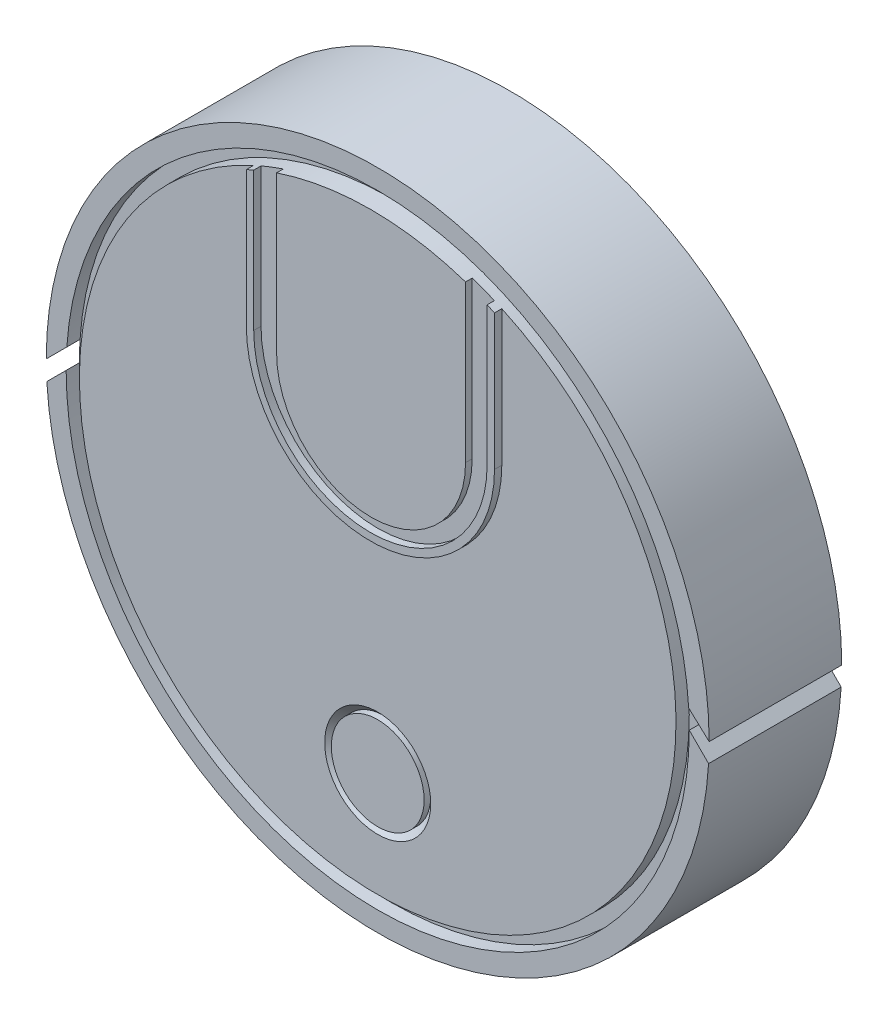
ISO-10303-21;
HEADER;
FILE_DESCRIPTION(('STEP AP214'),'2;1');
FILE_NAME('part.step','',(''),(''),'','','');
FILE_SCHEMA(('AUTOMOTIVE_DESIGN { 1 0 10303 214 1 1 1 1 }'));
ENDSEC;
DATA;
#1=APPLICATION_CONTEXT('core data for automotive mechanical design processes');
#2=APPLICATION_PROTOCOL_DEFINITION('international standard','automotive_design',2000,#1);
#3=PRODUCT_CONTEXT('',#1,'mechanical');
#4=PRODUCT('Part','Part','',(#3));
#5=PRODUCT_RELATED_PRODUCT_CATEGORY('part','',(#4));
#6=PRODUCT_DEFINITION_FORMATION('','',#4);
#7=PRODUCT_DEFINITION_CONTEXT('part definition',#1,'design');
#8=PRODUCT_DEFINITION('design','',#6,#7);
#9=PRODUCT_DEFINITION_SHAPE('','',#8);
#10=(LENGTH_UNIT() NAMED_UNIT(*) SI_UNIT(.MILLI.,.METRE.));
#11=(NAMED_UNIT(*) PLANE_ANGLE_UNIT() SI_UNIT($,.RADIAN.));
#12=(NAMED_UNIT(*) SI_UNIT($,.STERADIAN.) SOLID_ANGLE_UNIT());
#13=UNCERTAINTY_MEASURE_WITH_UNIT(LENGTH_MEASURE(1.E-05),#10,'distance_accuracy_value','');
#14=(GEOMETRIC_REPRESENTATION_CONTEXT(3) GLOBAL_UNCERTAINTY_ASSIGNED_CONTEXT((#13)) GLOBAL_UNIT_ASSIGNED_CONTEXT((#10,
#11,#12)) REPRESENTATION_CONTEXT('',''));
#15=CARTESIAN_POINT('',(0.,0.,0.));
#16=DIRECTION('',(0.,0.,1.));
#17=DIRECTION('',(1.,0.,0.));
#18=AXIS2_PLACEMENT_3D('',#15,#16,#17);
#19=CARTESIAN_POINT('',(0.,0.,20.));
#20=DIRECTION('',(0.,0.,1.));
#21=DIRECTION('',(1.,0.,0.));
#22=AXIS2_PLACEMENT_3D('',#19,#20,#21);
#23=PLANE('',#22);
#24=DIRECTION('',(0.,1.,0.));
#25=VECTOR('',#24,1.);
#26=CARTESIAN_POINT('',(-17.6027975874737,41.4142670718006,20.));
#27=LINE('',#26,#25);
#28=CARTESIAN_POINT('',(-17.6027975874737,20.4667448140072,20.));
#29=VERTEX_POINT('',#28);
#30=CARTESIAN_POINT('',(-17.6027975874737,41.4142670718006,20.));
#31=VERTEX_POINT('',#30);
#32=EDGE_CURVE('E54',#29,#31,#27,.T.);
#33=ORIENTED_EDGE('',*,*,#32,.F.);
#34=CARTESIAN_POINT('',(0.,20.4667448140072,20.));
#35=DIRECTION('',(0.,0.,-1.));
#36=DIRECTION('',(1.,0.,0.));
#37=AXIS2_PLACEMENT_3D('',#34,#35,#36);
#38=CIRCLE('',#37,17.6027975874737);
#39=CARTESIAN_POINT('',(17.6027975874737,20.4667448140072,20.));
#40=VERTEX_POINT('',#39);
#41=EDGE_CURVE('E59',#40,#29,#38,.T.);
#42=ORIENTED_EDGE('',*,*,#41,.F.);
#43=DIRECTION('',(0.,-1.,0.));
#44=VECTOR('',#43,1.);
#45=CARTESIAN_POINT('',(17.6027975874737,41.4142670718006,20.));
#46=LINE('',#45,#44);
#47=CARTESIAN_POINT('',(17.6027975874737,41.4142670718006,20.));
#48=VERTEX_POINT('',#47);
#49=EDGE_CURVE('E232',#48,#40,#46,.T.);
#50=ORIENTED_EDGE('',*,*,#49,.F.);
#51=CARTESIAN_POINT('',(0.,0.,20.));
#52=DIRECTION('',(0.,0.,1.));
#53=DIRECTION('',(1.,0.,0.));
#54=AXIS2_PLACEMENT_3D('',#51,#52,#53);
#55=CIRCLE('',#54,45.);
#56=CARTESIAN_POINT('',(14.2498837612882,42.6841986312239,20.));
#57=VERTEX_POINT('',#56);
#58=EDGE_CURVE('E293',#48,#57,#55,.T.);
#59=ORIENTED_EDGE('',*,*,#58,.T.);
#60=DIRECTION('',(0.,1.,0.));
#61=VECTOR('',#60,1.);
#62=CARTESIAN_POINT('',(14.2498837612882,42.6841986312239,20.));
#63=LINE('',#62,#61);
#64=CARTESIAN_POINT('',(14.2498837612882,19.0696973864299,20.));
#65=VERTEX_POINT('',#64);
#66=EDGE_CURVE('E266',#65,#57,#63,.T.);
#67=ORIENTED_EDGE('',*,*,#66,.F.);
#68=CARTESIAN_POINT('',(0.,19.0696973864299,20.));
#69=DIRECTION('',(0.,0.,1.));
#70=DIRECTION('',(1.,0.,0.));
#71=AXIS2_PLACEMENT_3D('',#68,#69,#70);
#72=CIRCLE('',#71,14.2498837612882);
#73=CARTESIAN_POINT('',(-14.2498837612882,19.0696973864299,20.));
#74=VERTEX_POINT('',#73);
#75=EDGE_CURVE('E241',#74,#65,#72,.T.);
#76=ORIENTED_EDGE('',*,*,#75,.F.);
#77=DIRECTION('',(0.,-1.,0.));
#78=VECTOR('',#77,1.);
#79=CARTESIAN_POINT('',(-14.2498837612882,42.6841986312239,20.));
#80=LINE('',#79,#78);
#81=CARTESIAN_POINT('',(-14.2498837612882,42.6841986312239,20.));
#82=VERTEX_POINT('',#81);
#83=EDGE_CURVE('E257',#82,#74,#80,.T.);
#84=ORIENTED_EDGE('',*,*,#83,.F.);
#85=EDGE_CURVE('E289',#82,#31,#55,.T.);
#86=ORIENTED_EDGE('',*,*,#85,.T.);
#87=EDGE_LOOP('',(#33,#42,#50,#59,#67,#76,#84,#86));
#88=FACE_BOUND('',#87,.T.);
#89=ADVANCED_FACE('F38',(#88),#23,.T.);
#90=CARTESIAN_POINT('',(0.,0.,18.));
#91=DIRECTION('',(0.,0.,-1.));
#92=DIRECTION('',(-1.,0.,0.));
#93=AXIS2_PLACEMENT_3D('',#90,#91,#92);
#94=CYLINDRICAL_SURFACE('',#93,47.);
#95=DIRECTION('',(0.,0.,-1.));
#96=VECTOR('',#95,1.);
#97=CARTESIAN_POINT('',(-46.8974884404582,3.10251155954182,20.));
#98=LINE('',#97,#96);
#99=CARTESIAN_POINT('',(-46.8974884404582,3.10251155954182,18.));
#100=VERTEX_POINT('',#99);
#101=CARTESIAN_POINT('',(-46.8974884404582,3.10251155954182,0.));
#102=VERTEX_POINT('',#101);
#103=EDGE_CURVE('E318',#100,#102,#98,.T.);
#104=ORIENTED_EDGE('',*,*,#103,.T.);
#105=CARTESIAN_POINT('',(0.,0.,0.));
#106=DIRECTION('',(0.,0.,1.));
#107=DIRECTION('',(1.,0.,0.));
#108=AXIS2_PLACEMENT_3D('',#105,#106,#107);
#109=CIRCLE('',#108,47.);
#110=CARTESIAN_POINT('',(-47.,0.,0.));
#111=VERTEX_POINT('',#110);
#112=EDGE_CURVE('E324',#102,#111,#109,.T.);
#113=ORIENTED_EDGE('',*,*,#112,.T.);
#114=DIRECTION('',(0.,0.,-1.));
#115=VECTOR('',#114,1.);
#116=CARTESIAN_POINT('',(-47.,0.,18.));
#117=LINE('',#116,#115);
#118=CARTESIAN_POINT('',(-47.,0.,18.));
#119=VERTEX_POINT('',#118);
#120=EDGE_CURVE('E337',#111,#119,#117,.F.);
#121=ORIENTED_EDGE('',*,*,#120,.T.);
#122=CARTESIAN_POINT('',(0.,0.,18.));
#123=DIRECTION('',(0.,0.,1.));
#124=DIRECTION('',(1.,0.,0.));
#125=AXIS2_PLACEMENT_3D('',#122,#123,#124);
#126=CIRCLE('',#125,47.);
#127=EDGE_CURVE('E330',#100,#119,#126,.T.);
#128=ORIENTED_EDGE('',*,*,#127,.F.);
#129=EDGE_LOOP('',(#104,#113,#121,#128));
#130=FACE_BOUND('',#129,.T.);
#131=ADVANCED_FACE('F375',(#130),#94,.T.);
#132=DIRECTION('',(0.,0.,-1.));
#133=VECTOR('',#132,1.);
#134=CARTESIAN_POINT('',(46.913413370577,2.85160409618335,20.));
#135=LINE('',#134,#133);
#136=CARTESIAN_POINT('',(46.913413370577,2.85160409618335,18.));
#137=VERTEX_POINT('',#136);
#138=CARTESIAN_POINT('',(46.913413370577,2.85160409618335,0.));
#139=VERTEX_POINT('',#138);
#140=EDGE_CURVE('E314',#137,#139,#135,.T.);
#141=ORIENTED_EDGE('',*,*,#140,.F.);
#142=CARTESIAN_POINT('',(47.,0.,18.));
#143=VERTEX_POINT('',#142);
#144=EDGE_CURVE('E325',#143,#137,#126,.T.);
#145=ORIENTED_EDGE('',*,*,#144,.F.);
#146=DIRECTION('',(0.,0.,-1.));
#147=VECTOR('',#146,1.);
#148=CARTESIAN_POINT('',(47.,0.,18.));
#149=LINE('',#148,#147);
#150=CARTESIAN_POINT('',(47.,0.,0.));
#151=VERTEX_POINT('',#150);
#152=EDGE_CURVE('E328',#143,#151,#149,.T.);
#153=ORIENTED_EDGE('',*,*,#152,.T.);
#154=EDGE_CURVE('E332',#151,#139,#109,.T.);
#155=ORIENTED_EDGE('',*,*,#154,.T.);
#156=EDGE_LOOP('',(#141,#145,#153,#155));
#157=FACE_BOUND('',#156,.T.);
#158=ADVANCED_FACE('F400',(#157),#94,.T.);
#159=CARTESIAN_POINT('',(0.,0.,20.));
#160=DIRECTION('',(0.,0.,-1.));
#161=DIRECTION('',(-1.,0.,0.));
#162=AXIS2_PLACEMENT_3D('',#159,#160,#161);
#163=CYLINDRICAL_SURFACE('',#162,47.);
#164=DIRECTION('',(0.,0.,-1.));
#165=VECTOR('',#164,1.);
#166=CARTESIAN_POINT('',(47.,0.,20.));
#167=LINE('',#166,#165);
#168=CARTESIAN_POINT('',(47.,0.,20.));
#169=VERTEX_POINT('',#168);
#170=EDGE_CURVE('E351',#169,#143,#167,.T.);
#171=ORIENTED_EDGE('',*,*,#170,.T.);
#172=EDGE_CURVE('E331',#119,#143,#126,.T.);
#173=ORIENTED_EDGE('',*,*,#172,.F.);
#174=DIRECTION('',(0.,0.,-1.));
#175=VECTOR('',#174,1.);
#176=CARTESIAN_POINT('',(-47.,0.,20.));
#177=LINE('',#176,#175);
#178=CARTESIAN_POINT('',(-47.,0.,20.));
#179=VERTEX_POINT('',#178);
#180=EDGE_CURVE('E47',#179,#119,#177,.T.);
#181=ORIENTED_EDGE('',*,*,#180,.F.);
#182=CARTESIAN_POINT('',(0.,0.,20.));
#183=DIRECTION('',(0.,0.,-1.));
#184=DIRECTION('',(1.,0.,0.));
#185=AXIS2_PLACEMENT_3D('',#182,#183,#184);
#186=CIRCLE('',#185,47.);
#187=EDGE_CURVE('E341',#169,#179,#186,.T.);
#188=ORIENTED_EDGE('',*,*,#187,.F.);
#189=EDGE_LOOP('',(#171,#173,#181,#188));
#190=FACE_BOUND('',#189,.T.);
#191=ADVANCED_FACE('F392',(#190),#163,.F.);
#192=CARTESIAN_POINT('',(-47.,0.,20.));
#193=DIRECTION('',(0.707106781186553,-0.707106781186542,0.));
#194=DIRECTION('',(0.707106781186542,0.707106781186553,0.));
#195=AXIS2_PLACEMENT_3D('',#192,#193,#194);
#196=PLANE('',#195);
#197=DIRECTION('',(-0.707106781186542,-0.707106781186553,0.));
#198=VECTOR('',#197,1.);
#199=CARTESIAN_POINT('',(-47.,0.,0.));
#200=LINE('',#199,#198);
#201=CARTESIAN_POINT('',(-49.9149578837446,-2.91495788374463,0.));
#202=VERTEX_POINT('',#201);
#203=EDGE_CURVE('E340',#111,#202,#200,.T.);
#204=ORIENTED_EDGE('',*,*,#203,.T.);
#205=DIRECTION('',(0.,0.,-1.));
#206=VECTOR('',#205,1.);
#207=CARTESIAN_POINT('',(-49.9149578837446,-2.91495788374463,20.));
#208=LINE('',#207,#206);
#209=CARTESIAN_POINT('',(-49.9149578837446,-2.91495788374463,20.));
#210=VERTEX_POINT('',#209);
#211=EDGE_CURVE('E361',#210,#202,#208,.T.);
#212=ORIENTED_EDGE('',*,*,#211,.F.);
#213=DIRECTION('',(-0.707106781186542,-0.707106781186553,0.));
#214=VECTOR('',#213,1.);
#215=CARTESIAN_POINT('',(-47.,0.,20.));
#216=LINE('',#215,#214);
#217=EDGE_CURVE('E344',#179,#210,#216,.T.);
#218=ORIENTED_EDGE('',*,*,#217,.F.);
#219=ORIENTED_EDGE('',*,*,#180,.T.);
#220=ORIENTED_EDGE('',*,*,#120,.F.);
#221=EDGE_LOOP('',(#204,#212,#218,#219,#220));
#222=FACE_BOUND('',#221,.T.);
#223=ADVANCED_FACE('F367',(#222),#196,.F.);
#224=CARTESIAN_POINT('',(0.,0.,20.));
#225=DIRECTION('',(0.,0.,-1.));
#226=DIRECTION('',(-1.,0.,0.));
#227=AXIS2_PLACEMENT_3D('',#224,#225,#226);
#228=CYLINDRICAL_SURFACE('',#227,50.);
#229=CARTESIAN_POINT('',(0.,0.,0.));
#230=DIRECTION('',(0.,0.,1.));
#231=DIRECTION('',(1.,0.,0.));
#232=AXIS2_PLACEMENT_3D('',#229,#230,#231);
#233=CIRCLE('',#232,50.);
#234=CARTESIAN_POINT('',(49.9149578837446,-2.91495788374451,0.));
#235=VERTEX_POINT('',#234);
#236=EDGE_CURVE('E353',#202,#235,#233,.T.);
#237=ORIENTED_EDGE('',*,*,#236,.T.);
#238=DIRECTION('',(0.,0.,-1.));
#239=VECTOR('',#238,1.);
#240=CARTESIAN_POINT('',(49.9149578837446,-2.91495788374451,20.));
#241=LINE('',#240,#239);
#242=CARTESIAN_POINT('',(49.9149578837446,-2.91495788374451,20.));
#243=VERTEX_POINT('',#242);
#244=EDGE_CURVE('E358',#243,#235,#241,.T.);
#245=ORIENTED_EDGE('',*,*,#244,.F.);
#246=CARTESIAN_POINT('',(0.,0.,20.));
#247=DIRECTION('',(0.,0.,1.));
#248=DIRECTION('',(1.,0.,0.));
#249=AXIS2_PLACEMENT_3D('',#246,#247,#248);
#250=CIRCLE('',#249,50.);
#251=EDGE_CURVE('E347',#210,#243,#250,.T.);
#252=ORIENTED_EDGE('',*,*,#251,.F.);
#253=ORIENTED_EDGE('',*,*,#211,.T.);
#254=EDGE_LOOP('',(#237,#245,#252,#253));
#255=FACE_BOUND('',#254,.T.);
#256=ADVANCED_FACE('F386',(#255),#228,.T.);
#257=CARTESIAN_POINT('',(47.,0.,20.));
#258=DIRECTION('',(-0.707106781186539,-0.707106781186556,0.));
#259=DIRECTION('',(0.707106781186556,-0.707106781186539,0.));
#260=AXIS2_PLACEMENT_3D('',#257,#258,#259);
#261=PLANE('',#260);
#262=DIRECTION('',(-0.707106781186556,0.707106781186539,0.));
#263=VECTOR('',#262,1.);
#264=CARTESIAN_POINT('',(47.,0.,0.));
#265=LINE('',#264,#263);
#266=EDGE_CURVE('E345',#235,#151,#265,.T.);
#267=ORIENTED_EDGE('',*,*,#266,.T.);
#268=ORIENTED_EDGE('',*,*,#152,.F.);
#269=ORIENTED_EDGE('',*,*,#170,.F.);
#270=DIRECTION('',(-0.707106781186556,0.707106781186539,0.));
#271=VECTOR('',#270,1.);
#272=CARTESIAN_POINT('',(47.,0.,20.));
#273=LINE('',#272,#271);
#274=EDGE_CURVE('E349',#243,#169,#273,.T.);
#275=ORIENTED_EDGE('',*,*,#274,.F.);
#276=ORIENTED_EDGE('',*,*,#244,.T.);
#277=EDGE_LOOP('',(#267,#268,#269,#275,#276));
#278=FACE_BOUND('',#277,.T.);
#279=ADVANCED_FACE('F629',(#278),#261,.F.);
#280=CARTESIAN_POINT('',(0.,0.,20.));
#281=DIRECTION('',(0.,0.,1.));
#282=DIRECTION('',(1.,0.,0.));
#283=AXIS2_PLACEMENT_3D('',#280,#281,#282);
#284=PLANE('',#283);
#285=ORIENTED_EDGE('',*,*,#187,.T.);
#286=ORIENTED_EDGE('',*,*,#217,.T.);
#287=ORIENTED_EDGE('',*,*,#251,.T.);
#288=ORIENTED_EDGE('',*,*,#274,.T.);
#289=EDGE_LOOP('',(#285,#286,#287,#288));
#290=FACE_BOUND('',#289,.T.);
#291=ADVANCED_FACE('F390',(#290),#284,.T.);
#292=CARTESIAN_POINT('',(0.,0.,0.));
#293=DIRECTION('',(0.,0.,1.));
#294=DIRECTION('',(1.,0.,0.));
#295=AXIS2_PLACEMENT_3D('',#292,#293,#294);
#296=PLANE('',#295);
#297=ORIENTED_EDGE('',*,*,#203,.F.);
#298=ORIENTED_EDGE('',*,*,#112,.F.);
#299=DIRECTION('',(0.707106781186546,0.70710678118655,0.));
#300=VECTOR('',#299,1.);
#301=CARTESIAN_POINT('',(-50.,0.,0.));
#302=LINE('',#301,#300);
#303=CARTESIAN_POINT('',(-50.,0.,0.));
#304=VERTEX_POINT('',#303);
#305=EDGE_CURVE('E309',#304,#102,#302,.T.);
#306=ORIENTED_EDGE('',*,*,#305,.F.);
#307=CARTESIAN_POINT('',(0.,0.,0.));
#308=DIRECTION('',(0.,0.,1.));
#309=DIRECTION('',(1.,0.,0.));
#310=AXIS2_PLACEMENT_3D('',#307,#308,#309);
#311=CIRCLE('',#310,50.);
#312=CARTESIAN_POINT('',(50.,0.,0.));
#313=VERTEX_POINT('',#312);
#314=EDGE_CURVE('E291',#313,#304,#311,.T.);
#315=ORIENTED_EDGE('',*,*,#314,.F.);
#316=DIRECTION('',(0.734513127406388,-0.678594478070436,0.));
#317=VECTOR('',#316,1.);
#318=CARTESIAN_POINT('',(50.,0.,0.));
#319=LINE('',#318,#317);
#320=EDGE_CURVE('E300',#139,#313,#319,.T.);
#321=ORIENTED_EDGE('',*,*,#320,.F.);
#322=ORIENTED_EDGE('',*,*,#154,.F.);
#323=ORIENTED_EDGE('',*,*,#266,.F.);
#324=ORIENTED_EDGE('',*,*,#236,.F.);
#325=EDGE_LOOP('',(#297,#298,#306,#315,#321,#322,#323,#324));
#326=FACE_BOUND('',#325,.T.);
#327=ADVANCED_FACE('F382',(#326),#296,.F.);
#328=CARTESIAN_POINT('',(0.,0.,18.));
#329=DIRECTION('',(0.,0.,1.));
#330=DIRECTION('',(1.,0.,0.));
#331=AXIS2_PLACEMENT_3D('',#328,#329,#330);
#332=PLANE('',#331);
#333=CARTESIAN_POINT('',(0.,0.,18.));
#334=DIRECTION('',(0.,0.,1.));
#335=DIRECTION('',(1.,0.,0.));
#336=AXIS2_PLACEMENT_3D('',#333,#334,#335);
#337=CIRCLE('',#336,45.);
#338=CARTESIAN_POINT('',(45.,0.,18.));
#339=VERTEX_POINT('',#338);
#340=EDGE_CURVE('E288',#339,#339,#337,.T.);
#341=ORIENTED_EDGE('',*,*,#340,.F.);
#342=EDGE_LOOP('',(#341));
#343=FACE_BOUND('',#342,.T.);
#344=ORIENTED_EDGE('',*,*,#144,.T.);
#345=EDGE_CURVE('E329',#137,#100,#126,.T.);
#346=ORIENTED_EDGE('',*,*,#345,.T.);
#347=ORIENTED_EDGE('',*,*,#127,.T.);
#348=ORIENTED_EDGE('',*,*,#172,.T.);
#349=EDGE_LOOP('',(#344,#346,#347,#348));
#350=FACE_BOUND('',#349,.T.);
#351=ADVANCED_FACE('F397',(#343,#350),#332,.T.);
#352=CARTESIAN_POINT('',(0.,0.,20.));
#353=DIRECTION('',(0.,0.,-1.));
#354=DIRECTION('',(-1.,0.,0.));
#355=AXIS2_PLACEMENT_3D('',#352,#353,#354);
#356=CYLINDRICAL_SURFACE('',#355,50.);
#357=ORIENTED_EDGE('',*,*,#314,.T.);
#358=DIRECTION('',(0.,0.,-1.));
#359=VECTOR('',#358,1.);
#360=CARTESIAN_POINT('',(-50.,0.,20.));
#361=LINE('',#360,#359);
#362=CARTESIAN_POINT('',(-50.,0.,20.));
#363=VERTEX_POINT('',#362);
#364=EDGE_CURVE('E321',#363,#304,#361,.T.);
#365=ORIENTED_EDGE('',*,*,#364,.F.);
#366=CARTESIAN_POINT('',(0.,0.,20.));
#367=DIRECTION('',(0.,0.,1.));
#368=DIRECTION('',(1.,0.,0.));
#369=AXIS2_PLACEMENT_3D('',#366,#367,#368);
#370=CIRCLE('',#369,50.);
#371=CARTESIAN_POINT('',(50.,0.,20.));
#372=VERTEX_POINT('',#371);
#373=EDGE_CURVE('E296',#372,#363,#370,.T.);
#374=ORIENTED_EDGE('',*,*,#373,.F.);
#375=DIRECTION('',(0.,0.,-1.));
#376=VECTOR('',#375,1.);
#377=CARTESIAN_POINT('',(50.,0.,20.));
#378=LINE('',#377,#376);
#379=EDGE_CURVE('E306',#372,#313,#378,.T.);
#380=ORIENTED_EDGE('',*,*,#379,.T.);
#381=EDGE_LOOP('',(#357,#365,#374,#380));
#382=FACE_BOUND('',#381,.T.);
#383=ADVANCED_FACE('F411',(#382),#356,.T.);
#384=CARTESIAN_POINT('',(-50.,0.,20.));
#385=DIRECTION('',(-0.70710678118655,0.707106781186546,0.));
#386=DIRECTION('',(-0.707106781186546,-0.70710678118655,0.));
#387=AXIS2_PLACEMENT_3D('',#384,#385,#386);
#388=PLANE('',#387);
#389=ORIENTED_EDGE('',*,*,#305,.T.);
#390=ORIENTED_EDGE('',*,*,#103,.F.);
#391=CARTESIAN_POINT('',(-46.8974884404582,3.10251155954182,20.));
#392=VERTEX_POINT('',#391);
#393=EDGE_CURVE('E319',#392,#100,#98,.T.);
#394=ORIENTED_EDGE('',*,*,#393,.F.);
#395=DIRECTION('',(0.707106781186546,0.70710678118655,0.));
#396=VECTOR('',#395,1.);
#397=CARTESIAN_POINT('',(-50.,0.,20.));
#398=LINE('',#397,#396);
#399=EDGE_CURVE('E299',#363,#392,#398,.T.);
#400=ORIENTED_EDGE('',*,*,#399,.F.);
#401=ORIENTED_EDGE('',*,*,#364,.T.);
#402=EDGE_LOOP('',(#389,#390,#394,#400,#401));
#403=FACE_BOUND('',#402,.T.);
#404=ADVANCED_FACE('F420',(#403),#388,.F.);
#405=CARTESIAN_POINT('',(0.,0.,20.));
#406=DIRECTION('',(0.,0.,-1.));
#407=DIRECTION('',(-1.,0.,0.));
#408=AXIS2_PLACEMENT_3D('',#405,#406,#407);
#409=CYLINDRICAL_SURFACE('',#408,47.);
#410=ORIENTED_EDGE('',*,*,#345,.F.);
#411=CARTESIAN_POINT('',(46.913413370577,2.85160409618335,20.));
#412=VERTEX_POINT('',#411);
#413=EDGE_CURVE('E315',#412,#137,#135,.T.);
#414=ORIENTED_EDGE('',*,*,#413,.F.);
#415=CARTESIAN_POINT('',(0.,0.,20.));
#416=DIRECTION('',(0.,0.,-1.));
#417=DIRECTION('',(1.,0.,0.));
#418=AXIS2_PLACEMENT_3D('',#415,#416,#417);
#419=CIRCLE('',#418,47.);
#420=EDGE_CURVE('E302',#392,#412,#419,.T.);
#421=ORIENTED_EDGE('',*,*,#420,.F.);
#422=ORIENTED_EDGE('',*,*,#393,.T.);
#423=EDGE_LOOP('',(#410,#414,#421,#422));
#424=FACE_BOUND('',#423,.T.);
#425=ADVANCED_FACE('F418',(#424),#409,.F.);
#426=CARTESIAN_POINT('',(50.,0.,20.));
#427=DIRECTION('',(0.678594478070436,0.734513127406388,0.));
#428=DIRECTION('',(-0.734513127406388,0.678594478070436,0.));
#429=AXIS2_PLACEMENT_3D('',#426,#427,#428);
#430=PLANE('',#429);
#431=ORIENTED_EDGE('',*,*,#320,.T.);
#432=ORIENTED_EDGE('',*,*,#379,.F.);
#433=DIRECTION('',(0.734513127406388,-0.678594478070436,0.));
#434=VECTOR('',#433,1.);
#435=CARTESIAN_POINT('',(50.,0.,20.));
#436=LINE('',#435,#434);
#437=EDGE_CURVE('E304',#412,#372,#436,.T.);
#438=ORIENTED_EDGE('',*,*,#437,.F.);
#439=ORIENTED_EDGE('',*,*,#413,.T.);
#440=ORIENTED_EDGE('',*,*,#140,.T.);
#441=EDGE_LOOP('',(#431,#432,#438,#439,#440));
#442=FACE_BOUND('',#441,.T.);
#443=ADVANCED_FACE('F404',(#442),#430,.F.);
#444=CARTESIAN_POINT('',(0.,0.,20.));
#445=DIRECTION('',(0.,0.,1.));
#446=DIRECTION('',(1.,0.,0.));
#447=AXIS2_PLACEMENT_3D('',#444,#445,#446);
#448=PLANE('',#447);
#449=ORIENTED_EDGE('',*,*,#373,.T.);
#450=ORIENTED_EDGE('',*,*,#399,.T.);
#451=ORIENTED_EDGE('',*,*,#420,.T.);
#452=ORIENTED_EDGE('',*,*,#437,.T.);
#453=EDGE_LOOP('',(#449,#450,#451,#452));
#454=FACE_BOUND('',#453,.T.);
#455=ADVANCED_FACE('F414',(#454),#448,.T.);
#456=CARTESIAN_POINT('',(0.,0.,20.));
#457=DIRECTION('',(0.,0.,-1.));
#458=DIRECTION('',(-1.,0.,0.));
#459=AXIS2_PLACEMENT_3D('',#456,#457,#458);
#460=CYLINDRICAL_SURFACE('',#459,45.);
#461=ORIENTED_EDGE('',*,*,#85,.F.);
#462=DIRECTION('',(0.,0.,-1.));
#463=VECTOR('',#462,1.);
#464=CARTESIAN_POINT('',(-14.2498837612882,42.6841986312239,21.));
#465=LINE('',#464,#463);
#466=CARTESIAN_POINT('',(-14.2498837612882,42.6841986312239,21.));
#467=VERTEX_POINT('',#466);
#468=EDGE_CURVE('E273',#467,#82,#465,.T.);
#469=ORIENTED_EDGE('',*,*,#468,.F.);
#470=CARTESIAN_POINT('',(0.,-2.70616862252382E-13,21.));
#471=DIRECTION('',(0.,0.,1.));
#472=DIRECTION('',(-1.,0.,0.));
#473=AXIS2_PLACEMENT_3D('',#470,#471,#472);
#474=CIRCLE('',#473,45.0000000000003);
#475=CARTESIAN_POINT('',(14.2498837612882,42.6841986312239,21.));
#476=VERTEX_POINT('',#475);
#477=EDGE_CURVE('E259',#476,#467,#474,.T.);
#478=ORIENTED_EDGE('',*,*,#477,.F.);
#479=DIRECTION('',(0.,0.,-1.));
#480=VECTOR('',#479,1.);
#481=CARTESIAN_POINT('',(14.2498837612882,42.6841986312239,21.));
#482=LINE('',#481,#480);
#483=EDGE_CURVE('E276',#476,#57,#482,.T.);
#484=ORIENTED_EDGE('',*,*,#483,.T.);
#485=ORIENTED_EDGE('',*,*,#58,.F.);
#486=DIRECTION('',(0.,0.,1.));
#487=VECTOR('',#486,1.);
#488=CARTESIAN_POINT('',(17.6027975874737,41.4142670718006,20.));
#489=LINE('',#488,#487);
#490=CARTESIAN_POINT('',(17.6027975874737,41.4142670718006,21.1));
#491=VERTEX_POINT('',#490);
#492=EDGE_CURVE('E250',#48,#491,#489,.T.);
#493=ORIENTED_EDGE('',*,*,#492,.T.);
#494=CARTESIAN_POINT('',(0.,0.,21.1));
#495=DIRECTION('',(0.,0.,1.));
#496=DIRECTION('',(-1.,0.,0.));
#497=AXIS2_PLACEMENT_3D('',#494,#495,#496);
#498=CIRCLE('',#497,44.9999999999999);
#499=CARTESIAN_POINT('',(18.7204355295356,40.9212083592909,21.1));
#500=VERTEX_POINT('',#499);
#501=EDGE_CURVE('E207',#500,#491,#498,.T.);
#502=ORIENTED_EDGE('',*,*,#501,.F.);
#503=DIRECTION('',(0.,0.,1.));
#504=VECTOR('',#503,1.);
#505=CARTESIAN_POINT('',(18.7204355295356,40.9212083592909,20.));
#506=LINE('',#505,#504);
#507=CARTESIAN_POINT('',(18.7204355295356,40.9212083592909,20.));
#508=VERTEX_POINT('',#507);
#509=EDGE_CURVE('E197',#508,#500,#506,.T.);
#510=ORIENTED_EDGE('',*,*,#509,.F.);
#511=CARTESIAN_POINT('',(-18.7204355295356,40.9212083592909,20.));
#512=VERTEX_POINT('',#511);
#513=EDGE_CURVE('E292',#512,#508,#55,.T.);
#514=ORIENTED_EDGE('',*,*,#513,.F.);
#515=DIRECTION('',(0.,0.,1.));
#516=VECTOR('',#515,1.);
#517=CARTESIAN_POINT('',(-18.7204355295356,40.9212083592909,20.));
#518=LINE('',#517,#516);
#519=CARTESIAN_POINT('',(-18.7204355295356,40.9212083592909,21.1));
#520=VERTEX_POINT('',#519);
#521=EDGE_CURVE('E242',#512,#520,#518,.T.);
#522=ORIENTED_EDGE('',*,*,#521,.T.);
#523=CARTESIAN_POINT('',(0.,0.,21.1));
#524=DIRECTION('',(0.,0.,1.));
#525=DIRECTION('',(-1.,0.,0.));
#526=AXIS2_PLACEMENT_3D('',#523,#524,#525);
#527=CIRCLE('',#526,44.9999999999999);
#528=CARTESIAN_POINT('',(-17.6027975874737,41.4142670718006,21.1));
#529=VERTEX_POINT('',#528);
#530=EDGE_CURVE('E226',#529,#520,#527,.T.);
#531=ORIENTED_EDGE('',*,*,#530,.F.);
#532=DIRECTION('',(0.,0.,1.));
#533=VECTOR('',#532,1.);
#534=CARTESIAN_POINT('',(-17.6027975874737,41.4142670718006,20.));
#535=LINE('',#534,#533);
#536=EDGE_CURVE('E244',#31,#529,#535,.T.);
#537=ORIENTED_EDGE('',*,*,#536,.F.);
#538=EDGE_LOOP('',(#461,#469,#478,#484,#485,#493,#502,#510,#514,#522,#531,#537));
#539=FACE_BOUND('',#538,.T.);
#540=ORIENTED_EDGE('',*,*,#340,.T.);
#541=EDGE_LOOP('',(#540));
#542=FACE_BOUND('',#541,.T.);
#543=ADVANCED_FACE('F441',(#539,#542),#460,.T.);
#544=DIRECTION('',(0.,-1.,0.));
#545=VECTOR('',#544,1.);
#546=CARTESIAN_POINT('',(-18.7204355295356,40.9212083592909,20.));
#547=LINE('',#546,#545);
#548=CARTESIAN_POINT('',(-18.7204355295356,20.4667448140072,20.));
#549=VERTEX_POINT('',#548);
#550=EDGE_CURVE('E198',#512,#549,#547,.T.);
#551=ORIENTED_EDGE('',*,*,#550,.F.);
#552=ORIENTED_EDGE('',*,*,#513,.T.);
#553=DIRECTION('',(0.,1.,0.));
#554=VECTOR('',#553,1.);
#555=CARTESIAN_POINT('',(18.7204355295356,40.9212083592909,20.));
#556=LINE('',#555,#554);
#557=CARTESIAN_POINT('',(18.7204355295356,20.4667448140072,20.));
#558=VERTEX_POINT('',#557);
#559=EDGE_CURVE('E230',#558,#508,#556,.T.);
#560=ORIENTED_EDGE('',*,*,#559,.F.);
#561=CARTESIAN_POINT('',(0.,20.4667448140072,20.));
#562=DIRECTION('',(0.,0.,1.));
#563=DIRECTION('',(1.,0.,0.));
#564=AXIS2_PLACEMENT_3D('',#561,#562,#563);
#565=CIRCLE('',#564,18.7204355295356);
#566=EDGE_CURVE('E194',#549,#558,#565,.T.);
#567=ORIENTED_EDGE('',*,*,#566,.F.);
#568=EDGE_LOOP('',(#551,#552,#560,#567));
#569=FACE_BOUND('',#568,.T.);
#570=CARTESIAN_POINT('',(0.,-29.1284388649862,20.));
#571=DIRECTION('',(0.,0.,1.));
#572=DIRECTION('',(1.,0.,0.));
#573=AXIS2_PLACEMENT_3D('',#570,#571,#572);
#574=CIRCLE('',#573,8.00000000000001);
#575=CARTESIAN_POINT('',(8.00000000000001,-29.1284388649862,20.));
#576=VERTEX_POINT('',#575);
#577=EDGE_CURVE('E11',#576,#576,#574,.F.);
#578=ORIENTED_EDGE('',*,*,#577,.T.);
#579=EDGE_LOOP('',(#578));
#580=FACE_BOUND('',#579,.T.);
#581=ADVANCED_FACE('F431',(#569,#580),#23,.T.);
#582=CARTESIAN_POINT('',(0.,-29.1284388649862,19.));
#583=DIRECTION('',(0.,0.,1.));
#584=DIRECTION('',(1.,0.,0.));
#585=AXIS2_PLACEMENT_3D('',#582,#583,#584);
#586=CONICAL_SURFACE('',#585,7.,0.785398163397448);
#587=ORIENTED_EDGE('',*,*,#577,.F.);
#588=EDGE_LOOP('',(#587));
#589=FACE_BOUND('',#588,.T.);
#590=CARTESIAN_POINT('',(0.,-29.1284388649862,19.));
#591=DIRECTION('',(0.,0.,1.));
#592=DIRECTION('',(1.,0.,0.));
#593=AXIS2_PLACEMENT_3D('',#590,#591,#592);
#594=CIRCLE('',#593,7.);
#595=CARTESIAN_POINT('',(7.,-29.1284388649862,19.));
#596=VERTEX_POINT('',#595);
#597=EDGE_CURVE('E285',#596,#596,#594,.T.);
#598=ORIENTED_EDGE('',*,*,#597,.F.);
#599=EDGE_LOOP('',(#598));
#600=FACE_BOUND('',#599,.T.);
#601=ADVANCED_FACE('F41',(#589,#600),#586,.F.);
#602=CARTESIAN_POINT('',(0.,-29.1284388649862,20.));
#603=DIRECTION('',(0.,0.,-1.));
#604=DIRECTION('',(-1.,0.,0.));
#605=AXIS2_PLACEMENT_3D('',#602,#603,#604);
#606=CYLINDRICAL_SURFACE('',#605,7.);
#607=CARTESIAN_POINT('',(0.,-29.1284388649862,20.));
#608=DIRECTION('',(0.,0.,1.));
#609=DIRECTION('',(1.,0.,0.));
#610=AXIS2_PLACEMENT_3D('',#607,#608,#609);
#611=CIRCLE('',#610,7.);
#612=CARTESIAN_POINT('',(7.,-29.1284388649862,20.));
#613=VERTEX_POINT('',#612);
#614=EDGE_CURVE('E282',#613,#613,#611,.T.);
#615=ORIENTED_EDGE('',*,*,#614,.F.);
#616=EDGE_LOOP('',(#615));
#617=FACE_BOUND('',#616,.T.);
#618=ORIENTED_EDGE('',*,*,#597,.T.);
#619=EDGE_LOOP('',(#618));
#620=FACE_BOUND('',#619,.T.);
#621=ADVANCED_FACE('F447',(#617,#620),#606,.T.);
#622=CARTESIAN_POINT('',(0.,-29.1284388649862,20.));
#623=DIRECTION('',(0.,0.,1.));
#624=DIRECTION('',(1.,0.,0.));
#625=AXIS2_PLACEMENT_3D('',#622,#623,#624);
#626=PLANE('',#625);
#627=ORIENTED_EDGE('',*,*,#614,.T.);
#628=EDGE_LOOP('',(#627));
#629=FACE_BOUND('',#628,.T.);
#630=ADVANCED_FACE('F458',(#629),#626,.T.);
#631=CARTESIAN_POINT('',(0.,19.0696973864299,21.));
#632=DIRECTION('',(0.,0.,-1.));
#633=DIRECTION('',(-1.,0.,0.));
#634=AXIS2_PLACEMENT_3D('',#631,#632,#633);
#635=CYLINDRICAL_SURFACE('',#634,14.2498837612882);
#636=ORIENTED_EDGE('',*,*,#75,.T.);
#637=DIRECTION('',(0.,0.,-1.));
#638=VECTOR('',#637,1.);
#639=CARTESIAN_POINT('',(14.2498837612882,19.0696973864299,21.));
#640=LINE('',#639,#638);
#641=CARTESIAN_POINT('',(14.2498837612882,19.0696973864299,21.));
#642=VERTEX_POINT('',#641);
#643=EDGE_CURVE('E279',#642,#65,#640,.T.);
#644=ORIENTED_EDGE('',*,*,#643,.F.);
#645=CARTESIAN_POINT('',(0.,19.0696973864299,21.));
#646=DIRECTION('',(0.,0.,1.));
#647=DIRECTION('',(1.,0.,0.));
#648=AXIS2_PLACEMENT_3D('',#645,#646,#647);
#649=CIRCLE('',#648,14.2498837612882);
#650=CARTESIAN_POINT('',(-14.2498837612882,19.0696973864299,21.));
#651=VERTEX_POINT('',#650);
#652=EDGE_CURVE('E253',#651,#642,#649,.T.);
#653=ORIENTED_EDGE('',*,*,#652,.F.);
#654=DIRECTION('',(0.,0.,-1.));
#655=VECTOR('',#654,1.);
#656=CARTESIAN_POINT('',(-14.2498837612882,19.0696973864299,21.));
#657=LINE('',#656,#655);
#658=EDGE_CURVE('E263',#651,#74,#657,.T.);
#659=ORIENTED_EDGE('',*,*,#658,.T.);
#660=EDGE_LOOP('',(#636,#644,#653,#659));
#661=FACE_BOUND('',#660,.T.);
#662=ADVANCED_FACE('F463',(#661),#635,.T.);
#663=CARTESIAN_POINT('',(14.2498837612882,42.6841986312239,21.));
#664=DIRECTION('',(-1.,0.,0.));
#665=DIRECTION('',(0.,-1.,0.));
#666=AXIS2_PLACEMENT_3D('',#663,#664,#665);
#667=PLANE('',#666);
#668=ORIENTED_EDGE('',*,*,#66,.T.);
#669=ORIENTED_EDGE('',*,*,#483,.F.);
#670=DIRECTION('',(0.,1.,0.));
#671=VECTOR('',#670,1.);
#672=CARTESIAN_POINT('',(14.2498837612882,42.6841986312239,21.));
#673=LINE('',#672,#671);
#674=EDGE_CURVE('E256',#642,#476,#673,.T.);
#675=ORIENTED_EDGE('',*,*,#674,.F.);
#676=ORIENTED_EDGE('',*,*,#643,.T.);
#677=EDGE_LOOP('',(#668,#669,#675,#676));
#678=FACE_BOUND('',#677,.T.);
#679=ADVANCED_FACE('F470',(#678),#667,.F.);
#680=CARTESIAN_POINT('',(-14.2498837612882,42.6841986312239,21.));
#681=DIRECTION('',(1.,0.,0.));
#682=DIRECTION('',(0.,1.,0.));
#683=AXIS2_PLACEMENT_3D('',#680,#681,#682);
#684=PLANE('',#683);
#685=ORIENTED_EDGE('',*,*,#83,.T.);
#686=ORIENTED_EDGE('',*,*,#658,.F.);
#687=DIRECTION('',(0.,-1.,0.));
#688=VECTOR('',#687,1.);
#689=CARTESIAN_POINT('',(-14.2498837612882,42.6841986312239,21.));
#690=LINE('',#689,#688);
#691=EDGE_CURVE('E261',#467,#651,#690,.T.);
#692=ORIENTED_EDGE('',*,*,#691,.F.);
#693=ORIENTED_EDGE('',*,*,#468,.T.);
#694=EDGE_LOOP('',(#685,#686,#692,#693));
#695=FACE_BOUND('',#694,.T.);
#696=ADVANCED_FACE('F474',(#695),#684,.F.);
#697=CARTESIAN_POINT('',(0.,19.0696973864299,21.));
#698=DIRECTION('',(0.,0.,1.));
#699=DIRECTION('',(1.,0.,0.));
#700=AXIS2_PLACEMENT_3D('',#697,#698,#699);
#701=PLANE('',#700);
#702=ORIENTED_EDGE('',*,*,#652,.T.);
#703=ORIENTED_EDGE('',*,*,#674,.T.);
#704=ORIENTED_EDGE('',*,*,#477,.T.);
#705=ORIENTED_EDGE('',*,*,#691,.T.);
#706=EDGE_LOOP('',(#702,#703,#704,#705));
#707=FACE_BOUND('',#706,.T.);
#708=ADVANCED_FACE('F478',(#707),#701,.T.);
#709=CARTESIAN_POINT('',(0.,20.4667448140072,20.));
#710=DIRECTION('',(0.,0.,1.));
#711=DIRECTION('',(1.,0.,0.));
#712=AXIS2_PLACEMENT_3D('',#709,#710,#711);
#713=CYLINDRICAL_SURFACE('',#712,18.7204355295356);
#714=DIRECTION('',(0.,0.,1.));
#715=VECTOR('',#714,1.);
#716=CARTESIAN_POINT('',(18.7204355295356,20.4667448140072,20.));
#717=LINE('',#716,#715);
#718=CARTESIAN_POINT('',(18.7204355295356,20.4667448140072,21.1));
#719=VERTEX_POINT('',#718);
#720=EDGE_CURVE('E188',#558,#719,#717,.T.);
#721=ORIENTED_EDGE('',*,*,#720,.T.);
#722=CARTESIAN_POINT('',(0.,20.4667448140072,21.1));
#723=DIRECTION('',(0.,0.,1.));
#724=DIRECTION('',(1.,0.,0.));
#725=AXIS2_PLACEMENT_3D('',#722,#723,#724);
#726=CIRCLE('',#725,18.7204355295356);
#727=CARTESIAN_POINT('',(-18.7204355295356,20.4667448140072,21.1));
#728=VERTEX_POINT('',#727);
#729=EDGE_CURVE('E193',#728,#719,#726,.T.);
#730=ORIENTED_EDGE('',*,*,#729,.F.);
#731=DIRECTION('',(0.,0.,1.));
#732=VECTOR('',#731,1.);
#733=CARTESIAN_POINT('',(-18.7204355295356,20.4667448140072,20.));
#734=LINE('',#733,#732);
#735=EDGE_CURVE('E239',#549,#728,#734,.T.);
#736=ORIENTED_EDGE('',*,*,#735,.F.);
#737=ORIENTED_EDGE('',*,*,#566,.T.);
#738=EDGE_LOOP('',(#721,#730,#736,#737));
#739=FACE_BOUND('',#738,.T.);
#740=ADVANCED_FACE('F190',(#739),#713,.T.);
#741=CARTESIAN_POINT('',(-18.7204355295356,40.9212083592909,20.));
#742=DIRECTION('',(-1.,0.,0.));
#743=DIRECTION('',(0.,-1.,0.));
#744=AXIS2_PLACEMENT_3D('',#741,#742,#743);
#745=PLANE('',#744);
#746=ORIENTED_EDGE('',*,*,#735,.T.);
#747=DIRECTION('',(0.,-1.,0.));
#748=VECTOR('',#747,1.);
#749=CARTESIAN_POINT('',(-18.7204355295356,40.9212083592909,21.1));
#750=LINE('',#749,#748);
#751=EDGE_CURVE('E213',#520,#728,#750,.T.);
#752=ORIENTED_EDGE('',*,*,#751,.F.);
#753=ORIENTED_EDGE('',*,*,#521,.F.);
#754=ORIENTED_EDGE('',*,*,#550,.T.);
#755=EDGE_LOOP('',(#746,#752,#753,#754));
#756=FACE_BOUND('',#755,.T.);
#757=ADVANCED_FACE('F485',(#756),#745,.T.);
#758=CARTESIAN_POINT('',(-17.6027975874737,41.4142670718006,20.));
#759=DIRECTION('',(1.,0.,0.));
#760=DIRECTION('',(0.,1.,0.));
#761=AXIS2_PLACEMENT_3D('',#758,#759,#760);
#762=PLANE('',#761);
#763=ORIENTED_EDGE('',*,*,#536,.T.);
#764=DIRECTION('',(0.,1.,0.));
#765=VECTOR('',#764,1.);
#766=CARTESIAN_POINT('',(-17.6027975874737,41.4142670718006,21.1));
#767=LINE('',#766,#765);
#768=CARTESIAN_POINT('',(-17.6027975874737,20.4667448140072,21.1));
#769=VERTEX_POINT('',#768);
#770=EDGE_CURVE('E223',#769,#529,#767,.T.);
#771=ORIENTED_EDGE('',*,*,#770,.F.);
#772=DIRECTION('',(0.,0.,1.));
#773=VECTOR('',#772,1.);
#774=CARTESIAN_POINT('',(-17.6027975874737,20.4667448140072,20.));
#775=LINE('',#774,#773);
#776=EDGE_CURVE('E246',#29,#769,#775,.T.);
#777=ORIENTED_EDGE('',*,*,#776,.F.);
#778=ORIENTED_EDGE('',*,*,#32,.T.);
#779=EDGE_LOOP('',(#763,#771,#777,#778));
#780=FACE_BOUND('',#779,.T.);
#781=ADVANCED_FACE('F495',(#780),#762,.T.);
#782=CARTESIAN_POINT('',(0.,20.4667448140072,20.));
#783=DIRECTION('',(0.,0.,1.));
#784=DIRECTION('',(1.,0.,0.));
#785=AXIS2_PLACEMENT_3D('',#782,#783,#784);
#786=CYLINDRICAL_SURFACE('',#785,17.6027975874737);
#787=ORIENTED_EDGE('',*,*,#776,.T.);
#788=CARTESIAN_POINT('',(0.,20.4667448140072,21.1));
#789=DIRECTION('',(0.,0.,-1.));
#790=DIRECTION('',(1.,0.,0.));
#791=AXIS2_PLACEMENT_3D('',#788,#789,#790);
#792=CIRCLE('',#791,17.6027975874737);
#793=CARTESIAN_POINT('',(17.6027975874737,20.4667448140072,21.1));
#794=VERTEX_POINT('',#793);
#795=EDGE_CURVE('E220',#794,#769,#792,.T.);
#796=ORIENTED_EDGE('',*,*,#795,.F.);
#797=DIRECTION('',(0.,0.,1.));
#798=VECTOR('',#797,1.);
#799=CARTESIAN_POINT('',(17.6027975874737,20.4667448140072,20.));
#800=LINE('',#799,#798);
#801=EDGE_CURVE('E248',#40,#794,#800,.T.);
#802=ORIENTED_EDGE('',*,*,#801,.F.);
#803=ORIENTED_EDGE('',*,*,#41,.T.);
#804=EDGE_LOOP('',(#787,#796,#802,#803));
#805=FACE_BOUND('',#804,.T.);
#806=ADVANCED_FACE('F491',(#805),#786,.F.);
#807=CARTESIAN_POINT('',(17.6027975874737,41.4142670718006,20.));
#808=DIRECTION('',(-1.,0.,0.));
#809=DIRECTION('',(0.,-1.,0.));
#810=AXIS2_PLACEMENT_3D('',#807,#808,#809);
#811=PLANE('',#810);
#812=ORIENTED_EDGE('',*,*,#801,.T.);
#813=DIRECTION('',(0.,-1.,0.));
#814=VECTOR('',#813,1.);
#815=CARTESIAN_POINT('',(17.6027975874737,41.4142670718006,21.1));
#816=LINE('',#815,#814);
#817=EDGE_CURVE('E217',#491,#794,#816,.T.);
#818=ORIENTED_EDGE('',*,*,#817,.F.);
#819=ORIENTED_EDGE('',*,*,#492,.F.);
#820=ORIENTED_EDGE('',*,*,#49,.T.);
#821=EDGE_LOOP('',(#812,#818,#819,#820));
#822=FACE_BOUND('',#821,.T.);
#823=ADVANCED_FACE('F488',(#822),#811,.T.);
#824=CARTESIAN_POINT('',(18.7204355295356,40.9212083592909,20.));
#825=DIRECTION('',(1.,0.,0.));
#826=DIRECTION('',(0.,1.,0.));
#827=AXIS2_PLACEMENT_3D('',#824,#825,#826);
#828=PLANE('',#827);
#829=ORIENTED_EDGE('',*,*,#509,.T.);
#830=DIRECTION('',(0.,1.,0.));
#831=VECTOR('',#830,1.);
#832=CARTESIAN_POINT('',(18.7204355295356,40.9212083592909,21.1));
#833=LINE('',#832,#831);
#834=EDGE_CURVE('E201',#719,#500,#833,.T.);
#835=ORIENTED_EDGE('',*,*,#834,.F.);
#836=ORIENTED_EDGE('',*,*,#720,.F.);
#837=ORIENTED_EDGE('',*,*,#559,.T.);
#838=EDGE_LOOP('',(#829,#835,#836,#837));
#839=FACE_BOUND('',#838,.T.);
#840=ADVANCED_FACE('F202',(#839),#828,.T.);
#841=CARTESIAN_POINT('',(0.,20.4667448140072,21.1));
#842=DIRECTION('',(0.,0.,1.));
#843=DIRECTION('',(1.,0.,0.));
#844=AXIS2_PLACEMENT_3D('',#841,#842,#843);
#845=PLANE('',#844);
#846=ORIENTED_EDGE('',*,*,#729,.T.);
#847=ORIENTED_EDGE('',*,*,#834,.T.);
#848=ORIENTED_EDGE('',*,*,#501,.T.);
#849=ORIENTED_EDGE('',*,*,#817,.T.);
#850=ORIENTED_EDGE('',*,*,#795,.T.);
#851=ORIENTED_EDGE('',*,*,#770,.T.);
#852=ORIENTED_EDGE('',*,*,#530,.T.);
#853=ORIENTED_EDGE('',*,*,#751,.T.);
#854=EDGE_LOOP('',(#846,#847,#848,#849,#850,#851,#852,#853));
#855=FACE_BOUND('',#854,.T.);
#856=ADVANCED_FACE('F210',(#855),#845,.T.);
#857=CLOSED_SHELL('',(#89,#131,#158,#191,#223,#256,#279,#291,#327,#351,#383,#404,#425,#443,#455,
#543,#581,#601,#621,#630,#662,#679,#696,#708,#740,#757,#781,#806,#823,#840,#856));
#858=MANIFOLD_SOLID_BREP('B2',#857);
#859=ADVANCED_BREP_SHAPE_REPRESENTATION('',(#18,#858),#14);
#860=SHAPE_DEFINITION_REPRESENTATION(#9,#859);
ENDSEC;
END-ISO-10303-21;
